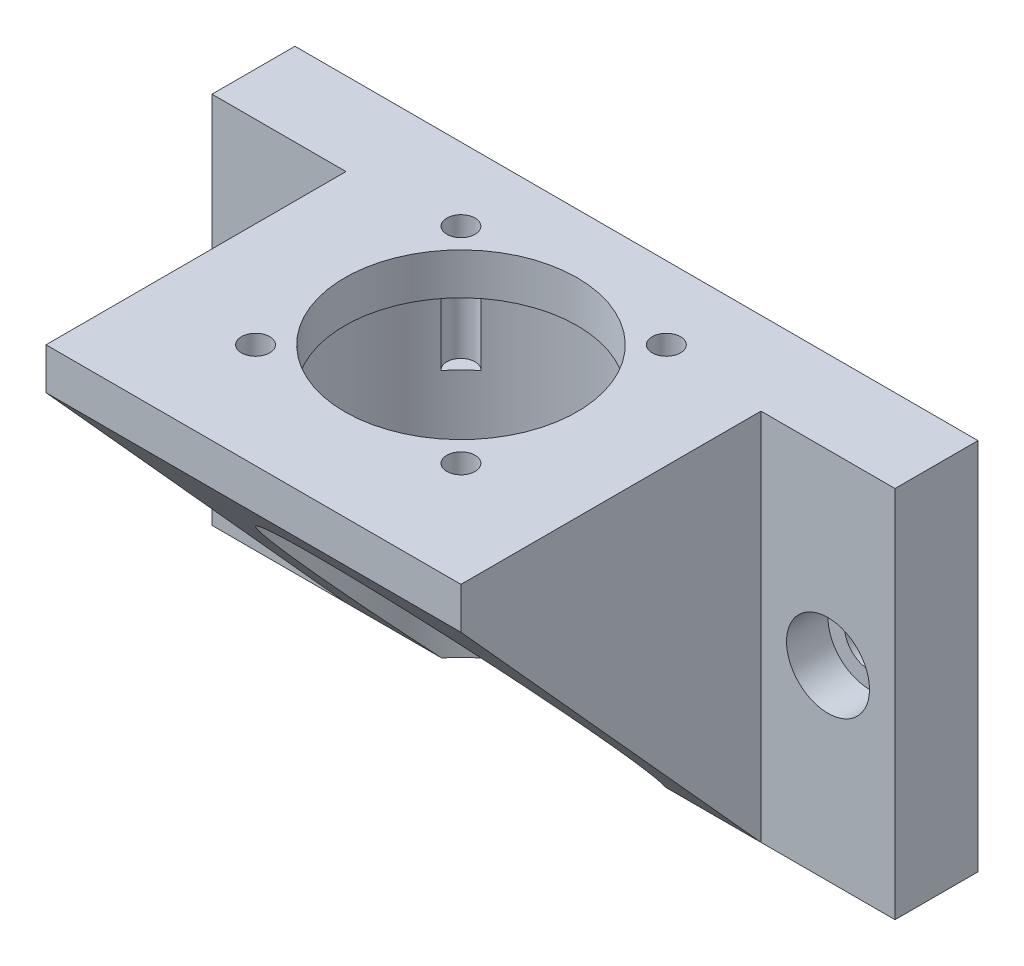
ISO-10303-21;
HEADER;
FILE_DESCRIPTION(('STEP AP214'),'2;1');
FILE_NAME('part.step','',(''),(''),'','','');
FILE_SCHEMA(('AUTOMOTIVE_DESIGN { 1 0 10303 214 1 1 1 1 }'));
ENDSEC;
DATA;
#1=APPLICATION_CONTEXT('core data for automotive mechanical design processes');
#2=APPLICATION_PROTOCOL_DEFINITION('international standard','automotive_design',2000,#1);
#3=PRODUCT_CONTEXT('',#1,'mechanical');
#4=PRODUCT('Part','Part','',(#3));
#5=PRODUCT_RELATED_PRODUCT_CATEGORY('part','',(#4));
#6=PRODUCT_DEFINITION_FORMATION('','',#4);
#7=PRODUCT_DEFINITION_CONTEXT('part definition',#1,'design');
#8=PRODUCT_DEFINITION('design','',#6,#7);
#9=PRODUCT_DEFINITION_SHAPE('','',#8);
#10=(LENGTH_UNIT() NAMED_UNIT(*) SI_UNIT(.MILLI.,.METRE.));
#11=(NAMED_UNIT(*) PLANE_ANGLE_UNIT() SI_UNIT($,.RADIAN.));
#12=(NAMED_UNIT(*) SI_UNIT($,.STERADIAN.) SOLID_ANGLE_UNIT());
#13=UNCERTAINTY_MEASURE_WITH_UNIT(LENGTH_MEASURE(1.E-05),#10,'distance_accuracy_value','');
#14=(GEOMETRIC_REPRESENTATION_CONTEXT(3) GLOBAL_UNCERTAINTY_ASSIGNED_CONTEXT((#13)) GLOBAL_UNIT_ASSIGNED_CONTEXT((#10,
#11,#12)) REPRESENTATION_CONTEXT('',''));
#15=CARTESIAN_POINT('',(0.,0.,0.));
#16=DIRECTION('',(0.,0.,1.));
#17=DIRECTION('',(1.,0.,0.));
#18=AXIS2_PLACEMENT_3D('',#15,#16,#17);
#19=CARTESIAN_POINT('',(33.075,22.5,-21.15));
#20=DIRECTION('',(0.,0.,1.));
#21=DIRECTION('',(1.,0.,0.));
#22=AXIS2_PLACEMENT_3D('',#19,#20,#21);
#23=CYLINDRICAL_SURFACE('',#22,3.);
#24=CARTESIAN_POINT('',(33.075,22.5,-21.15));
#25=DIRECTION('',(0.,0.,1.));
#26=DIRECTION('',(1.,0.,0.));
#27=AXIS2_PLACEMENT_3D('',#24,#25,#26);
#28=CIRCLE('',#27,3.);
#29=CARTESIAN_POINT('',(36.075,22.5,-21.15));
#30=VERTEX_POINT('',#29);
#31=EDGE_CURVE('E234',#30,#30,#28,.T.);
#32=ORIENTED_EDGE('',*,*,#31,.F.);
#33=EDGE_LOOP('',(#32));
#34=FACE_BOUND('',#33,.T.);
#35=CARTESIAN_POINT('',(33.075,22.5,-16.15));
#36=DIRECTION('',(0.,0.,1.));
#37=DIRECTION('',(1.,0.,0.));
#38=AXIS2_PLACEMENT_3D('',#35,#36,#37);
#39=CIRCLE('',#38,3.);
#40=CARTESIAN_POINT('',(36.075,22.5,-16.15));
#41=VERTEX_POINT('',#40);
#42=EDGE_CURVE('E236',#41,#41,#39,.F.);
#43=ORIENTED_EDGE('',*,*,#42,.F.);
#44=EDGE_LOOP('',(#43));
#45=FACE_BOUND('',#44,.T.);
#46=ADVANCED_FACE('F35',(#34,#45),#23,.F.);
#47=CARTESIAN_POINT('',(-33.075,22.5,-21.15));
#48=DIRECTION('',(0.,0.,1.));
#49=DIRECTION('',(1.,0.,0.));
#50=AXIS2_PLACEMENT_3D('',#47,#48,#49);
#51=CYLINDRICAL_SURFACE('',#50,3.);
#52=CARTESIAN_POINT('',(-33.075,22.5,-21.15));
#53=DIRECTION('',(0.,0.,1.));
#54=DIRECTION('',(1.,0.,0.));
#55=AXIS2_PLACEMENT_3D('',#52,#53,#54);
#56=CIRCLE('',#55,3.);
#57=CARTESIAN_POINT('',(-30.075,22.5,-21.15));
#58=VERTEX_POINT('',#57);
#59=EDGE_CURVE('E258',#58,#58,#56,.T.);
#60=ORIENTED_EDGE('',*,*,#59,.F.);
#61=EDGE_LOOP('',(#60));
#62=FACE_BOUND('',#61,.T.);
#63=CARTESIAN_POINT('',(-33.075,22.5,-16.15));
#64=DIRECTION('',(0.,0.,1.));
#65=DIRECTION('',(1.,0.,0.));
#66=AXIS2_PLACEMENT_3D('',#63,#64,#65);
#67=CIRCLE('',#66,3.);
#68=CARTESIAN_POINT('',(-30.075,22.5,-16.15));
#69=VERTEX_POINT('',#68);
#70=EDGE_CURVE('E232',#69,#69,#67,.F.);
#71=ORIENTED_EDGE('',*,*,#70,.F.);
#72=EDGE_LOOP('',(#71));
#73=FACE_BOUND('',#72,.T.);
#74=ADVANCED_FACE('F374',(#62,#73),#51,.F.);
#75=CARTESIAN_POINT('',(-21.15,45.,-21.15));
#76=DIRECTION('',(0.,0.,1.));
#77=DIRECTION('',(1.,0.,0.));
#78=AXIS2_PLACEMENT_3D('',#75,#76,#77);
#79=PLANE('',#78);
#80=ORIENTED_EDGE('',*,*,#31,.T.);
#81=EDGE_LOOP('',(#80));
#82=FACE_BOUND('',#81,.T.);
#83=ORIENTED_EDGE('',*,*,#59,.T.);
#84=EDGE_LOOP('',(#83));
#85=FACE_BOUND('',#84,.T.);
#86=DIRECTION('',(-1.,0.,0.));
#87=VECTOR('',#86,1.);
#88=CARTESIAN_POINT('',(-21.15,0.,-21.15));
#89=LINE('',#88,#87);
#90=CARTESIAN_POINT('',(41.15,0.,-21.15));
#91=VERTEX_POINT('',#90);
#92=CARTESIAN_POINT('',(-41.15,0.,-21.15));
#93=VERTEX_POINT('',#92);
#94=EDGE_CURVE('E316',#91,#93,#89,.T.);
#95=ORIENTED_EDGE('',*,*,#94,.T.);
#96=DIRECTION('',(0.,-1.,0.));
#97=VECTOR('',#96,1.);
#98=CARTESIAN_POINT('',(-41.15,45.,-21.15));
#99=LINE('',#98,#97);
#100=CARTESIAN_POINT('',(-41.15,45.,-21.15));
#101=VERTEX_POINT('',#100);
#102=EDGE_CURVE('E209',#101,#93,#99,.T.);
#103=ORIENTED_EDGE('',*,*,#102,.F.);
#104=DIRECTION('',(-1.,0.,0.));
#105=VECTOR('',#104,1.);
#106=CARTESIAN_POINT('',(21.15,45.,-21.15));
#107=LINE('',#106,#105);
#108=CARTESIAN_POINT('',(41.15,45.,-21.15));
#109=VERTEX_POINT('',#108);
#110=EDGE_CURVE('E187',#109,#101,#107,.T.);
#111=ORIENTED_EDGE('',*,*,#110,.F.);
#112=DIRECTION('',(0.,-1.,0.));
#113=VECTOR('',#112,1.);
#114=CARTESIAN_POINT('',(41.15,45.,-21.15));
#115=LINE('',#114,#113);
#116=EDGE_CURVE('E194',#109,#91,#115,.T.);
#117=ORIENTED_EDGE('',*,*,#116,.T.);
#118=EDGE_LOOP('',(#95,#103,#111,#117));
#119=FACE_BOUND('',#118,.T.);
#120=ADVANCED_FACE('F37',(#82,#85,#119),#79,.F.);
#121=CARTESIAN_POINT('',(-41.15,45.,-21.15));
#122=DIRECTION('',(1.,0.,0.));
#123=DIRECTION('',(0.,0.,-1.));
#124=AXIS2_PLACEMENT_3D('',#121,#122,#123);
#125=PLANE('',#124);
#126=DIRECTION('',(0.,0.,1.));
#127=VECTOR('',#126,1.);
#128=CARTESIAN_POINT('',(-41.15,0.,-21.15));
#129=LINE('',#128,#127);
#130=CARTESIAN_POINT('',(-41.15,0.,-11.15));
#131=VERTEX_POINT('',#130);
#132=EDGE_CURVE('E190',#93,#131,#129,.T.);
#133=ORIENTED_EDGE('',*,*,#132,.T.);
#134=DIRECTION('',(0.,-1.,0.));
#135=VECTOR('',#134,1.);
#136=CARTESIAN_POINT('',(-41.15,45.,-11.15));
#137=LINE('',#136,#135);
#138=CARTESIAN_POINT('',(-41.15,45.,-11.15));
#139=VERTEX_POINT('',#138);
#140=EDGE_CURVE('E206',#139,#131,#137,.T.);
#141=ORIENTED_EDGE('',*,*,#140,.F.);
#142=DIRECTION('',(0.,0.,1.));
#143=VECTOR('',#142,1.);
#144=CARTESIAN_POINT('',(-41.15,45.,-21.15));
#145=LINE('',#144,#143);
#146=EDGE_CURVE('E321',#101,#139,#145,.T.);
#147=ORIENTED_EDGE('',*,*,#146,.F.);
#148=ORIENTED_EDGE('',*,*,#102,.T.);
#149=EDGE_LOOP('',(#133,#141,#147,#148));
#150=FACE_BOUND('',#149,.T.);
#151=ADVANCED_FACE('F336',(#150),#125,.F.);
#152=CARTESIAN_POINT('',(-41.15,45.,-11.15));
#153=DIRECTION('',(0.,0.,-1.));
#154=DIRECTION('',(-1.,0.,0.));
#155=AXIS2_PLACEMENT_3D('',#152,#153,#154);
#156=PLANE('',#155);
#157=CARTESIAN_POINT('',(-33.075,22.5,-11.15));
#158=DIRECTION('',(0.,0.,1.));
#159=DIRECTION('',(1.,0.,0.));
#160=AXIS2_PLACEMENT_3D('',#157,#158,#159);
#161=CIRCLE('',#160,5.);
#162=CARTESIAN_POINT('',(-28.075,22.5,-11.15));
#163=VERTEX_POINT('',#162);
#164=EDGE_CURVE('E238',#163,#163,#161,.T.);
#165=ORIENTED_EDGE('',*,*,#164,.F.);
#166=EDGE_LOOP('',(#165));
#167=FACE_BOUND('',#166,.T.);
#168=DIRECTION('',(1.,0.,0.));
#169=VECTOR('',#168,1.);
#170=CARTESIAN_POINT('',(-41.15,0.,-11.15));
#171=LINE('',#170,#169);
#172=CARTESIAN_POINT('',(-25.,0.,-11.15));
#173=VERTEX_POINT('',#172);
#174=EDGE_CURVE('E185',#131,#173,#171,.T.);
#175=ORIENTED_EDGE('',*,*,#174,.T.);
#176=DIRECTION('',(0.,-1.,0.));
#177=VECTOR('',#176,1.);
#178=CARTESIAN_POINT('',(-25.,45.,-11.15));
#179=LINE('',#178,#177);
#180=CARTESIAN_POINT('',(-25.,45.,-11.15));
#181=VERTEX_POINT('',#180);
#182=EDGE_CURVE('E203',#181,#173,#179,.T.);
#183=ORIENTED_EDGE('',*,*,#182,.F.);
#184=DIRECTION('',(1.,0.,0.));
#185=VECTOR('',#184,1.);
#186=CARTESIAN_POINT('',(-41.15,45.,-11.15));
#187=LINE('',#186,#185);
#188=EDGE_CURVE('E323',#139,#181,#187,.T.);
#189=ORIENTED_EDGE('',*,*,#188,.F.);
#190=ORIENTED_EDGE('',*,*,#140,.T.);
#191=EDGE_LOOP('',(#175,#183,#189,#190));
#192=FACE_BOUND('',#191,.T.);
#193=ADVANCED_FACE('F342',(#167,#192),#156,.F.);
#194=CARTESIAN_POINT('',(-25.,45.,-11.15));
#195=DIRECTION('',(1.,0.,0.));
#196=DIRECTION('',(0.,0.,-1.));
#197=AXIS2_PLACEMENT_3D('',#194,#195,#196);
#198=PLANE('',#197);
#199=ORIENTED_EDGE('',*,*,#182,.T.);
#200=DIRECTION('',(0.,0.741909162750844,0.670500405836075));
#201=VECTOR('',#200,1.);
#202=CARTESIAN_POINT('',(-25.,24.7693142598146,11.2352677623075));
#203=LINE('',#202,#201);
#204=CARTESIAN_POINT('',(-25.,40.,25.));
#205=VERTEX_POINT('',#204);
#206=EDGE_CURVE('E250',#173,#205,#203,.T.);
#207=ORIENTED_EDGE('',*,*,#206,.T.);
#208=DIRECTION('',(0.,-1.,0.));
#209=VECTOR('',#208,1.);
#210=CARTESIAN_POINT('',(-25.,45.,25.));
#211=LINE('',#210,#209);
#212=CARTESIAN_POINT('',(-25.,45.,25.));
#213=VERTEX_POINT('',#212);
#214=EDGE_CURVE('E200',#213,#205,#211,.T.);
#215=ORIENTED_EDGE('',*,*,#214,.F.);
#216=DIRECTION('',(0.,0.,1.));
#217=VECTOR('',#216,1.);
#218=CARTESIAN_POINT('',(-25.,45.,-11.15));
#219=LINE('',#218,#217);
#220=EDGE_CURVE('E325',#181,#213,#219,.T.);
#221=ORIENTED_EDGE('',*,*,#220,.F.);
#222=EDGE_LOOP('',(#199,#207,#215,#221));
#223=FACE_BOUND('',#222,.T.);
#224=ADVANCED_FACE('F350',(#223),#198,.F.);
#225=CARTESIAN_POINT('',(-25.,45.,25.));
#226=DIRECTION('',(0.,0.,-1.));
#227=DIRECTION('',(-1.,0.,0.));
#228=AXIS2_PLACEMENT_3D('',#225,#226,#227);
#229=PLANE('',#228);
#230=ORIENTED_EDGE('',*,*,#214,.T.);
#231=DIRECTION('',(1.,0.,0.));
#232=VECTOR('',#231,1.);
#233=CARTESIAN_POINT('',(-41.15,40.,25.));
#234=LINE('',#233,#232);
#235=CARTESIAN_POINT('',(25.,40.,25.));
#236=VERTEX_POINT('',#235);
#237=EDGE_CURVE('E344',#205,#236,#234,.T.);
#238=ORIENTED_EDGE('',*,*,#237,.T.);
#239=DIRECTION('',(0.,-1.,0.));
#240=VECTOR('',#239,1.);
#241=CARTESIAN_POINT('',(25.,45.,25.));
#242=LINE('',#241,#240);
#243=CARTESIAN_POINT('',(25.,45.,25.));
#244=VERTEX_POINT('',#243);
#245=EDGE_CURVE('E171',#244,#236,#242,.T.);
#246=ORIENTED_EDGE('',*,*,#245,.F.);
#247=DIRECTION('',(1.,0.,0.));
#248=VECTOR('',#247,1.);
#249=CARTESIAN_POINT('',(-25.,45.,25.));
#250=LINE('',#249,#248);
#251=EDGE_CURVE('E327',#213,#244,#250,.T.);
#252=ORIENTED_EDGE('',*,*,#251,.F.);
#253=EDGE_LOOP('',(#230,#238,#246,#252));
#254=FACE_BOUND('',#253,.T.);
#255=ADVANCED_FACE('F353',(#254),#229,.F.);
#256=CARTESIAN_POINT('',(25.,45.,-11.15));
#257=DIRECTION('',(-1.,0.,0.));
#258=DIRECTION('',(0.,0.,1.));
#259=AXIS2_PLACEMENT_3D('',#256,#257,#258);
#260=PLANE('',#259);
#261=ORIENTED_EDGE('',*,*,#245,.T.);
#262=DIRECTION('',(0.,0.741909162750844,0.670500405836075));
#263=VECTOR('',#262,1.);
#264=CARTESIAN_POINT('',(25.,40.,25.));
#265=LINE('',#264,#263);
#266=CARTESIAN_POINT('',(25.,0.,-11.15));
#267=VERTEX_POINT('',#266);
#268=EDGE_CURVE('E155',#267,#236,#265,.T.);
#269=ORIENTED_EDGE('',*,*,#268,.F.);
#270=DIRECTION('',(0.,-1.,0.));
#271=VECTOR('',#270,1.);
#272=CARTESIAN_POINT('',(25.,45.,-11.15));
#273=LINE('',#272,#271);
#274=CARTESIAN_POINT('',(25.,45.,-11.15));
#275=VERTEX_POINT('',#274);
#276=EDGE_CURVE('E168',#275,#267,#273,.T.);
#277=ORIENTED_EDGE('',*,*,#276,.F.);
#278=DIRECTION('',(0.,0.,-1.));
#279=VECTOR('',#278,1.);
#280=CARTESIAN_POINT('',(25.,45.,-11.15));
#281=LINE('',#280,#279);
#282=EDGE_CURVE('E329',#244,#275,#281,.T.);
#283=ORIENTED_EDGE('',*,*,#282,.F.);
#284=EDGE_LOOP('',(#261,#269,#277,#283));
#285=FACE_BOUND('',#284,.T.);
#286=ADVANCED_FACE('F166',(#285),#260,.F.);
#287=CARTESIAN_POINT('',(41.15,45.,-11.15));
#288=DIRECTION('',(0.,0.,-1.));
#289=DIRECTION('',(-1.,0.,0.));
#290=AXIS2_PLACEMENT_3D('',#287,#288,#289);
#291=PLANE('',#290);
#292=CARTESIAN_POINT('',(33.075,22.5,-11.15));
#293=DIRECTION('',(0.,0.,1.));
#294=DIRECTION('',(1.,0.,0.));
#295=AXIS2_PLACEMENT_3D('',#292,#293,#294);
#296=CIRCLE('',#295,5.);
#297=CARTESIAN_POINT('',(38.075,22.5,-11.15));
#298=VERTEX_POINT('',#297);
#299=EDGE_CURVE('E245',#298,#298,#296,.T.);
#300=ORIENTED_EDGE('',*,*,#299,.F.);
#301=EDGE_LOOP('',(#300));
#302=FACE_BOUND('',#301,.T.);
#303=DIRECTION('',(1.,0.,0.));
#304=VECTOR('',#303,1.);
#305=CARTESIAN_POINT('',(41.15,0.,-11.15));
#306=LINE('',#305,#304);
#307=CARTESIAN_POINT('',(41.15,0.,-11.15));
#308=VERTEX_POINT('',#307);
#309=EDGE_CURVE('E176',#267,#308,#306,.T.);
#310=ORIENTED_EDGE('',*,*,#309,.T.);
#311=DIRECTION('',(0.,-1.,0.));
#312=VECTOR('',#311,1.);
#313=CARTESIAN_POINT('',(41.15,45.,-11.15));
#314=LINE('',#313,#312);
#315=CARTESIAN_POINT('',(41.15,45.,-11.15));
#316=VERTEX_POINT('',#315);
#317=EDGE_CURVE('E179',#316,#308,#314,.T.);
#318=ORIENTED_EDGE('',*,*,#317,.F.);
#319=DIRECTION('',(1.,0.,0.));
#320=VECTOR('',#319,1.);
#321=CARTESIAN_POINT('',(41.15,45.,-11.15));
#322=LINE('',#321,#320);
#323=EDGE_CURVE('E178',#275,#316,#322,.T.);
#324=ORIENTED_EDGE('',*,*,#323,.F.);
#325=ORIENTED_EDGE('',*,*,#276,.T.);
#326=EDGE_LOOP('',(#310,#318,#324,#325));
#327=FACE_BOUND('',#326,.T.);
#328=ADVANCED_FACE('F174',(#302,#327),#291,.F.);
#329=CARTESIAN_POINT('',(41.15,45.,-21.15));
#330=DIRECTION('',(-1.,0.,0.));
#331=DIRECTION('',(0.,0.,1.));
#332=AXIS2_PLACEMENT_3D('',#329,#330,#331);
#333=PLANE('',#332);
#334=DIRECTION('',(0.,0.,-1.));
#335=VECTOR('',#334,1.);
#336=CARTESIAN_POINT('',(41.15,0.,-21.15));
#337=LINE('',#336,#335);
#338=EDGE_CURVE('E184',#308,#91,#337,.T.);
#339=ORIENTED_EDGE('',*,*,#338,.T.);
#340=ORIENTED_EDGE('',*,*,#116,.F.);
#341=DIRECTION('',(0.,0.,-1.));
#342=VECTOR('',#341,1.);
#343=CARTESIAN_POINT('',(41.15,45.,-21.15));
#344=LINE('',#343,#342);
#345=EDGE_CURVE('E197',#316,#109,#344,.T.);
#346=ORIENTED_EDGE('',*,*,#345,.F.);
#347=ORIENTED_EDGE('',*,*,#317,.T.);
#348=EDGE_LOOP('',(#339,#340,#346,#347));
#349=FACE_BOUND('',#348,.T.);
#350=ADVANCED_FACE('F361',(#349),#333,.F.);
#351=CARTESIAN_POINT('',(0.,45.,0.));
#352=DIRECTION('',(0.,-1.,0.));
#353=DIRECTION('',(0.,0.,-1.));
#354=AXIS2_PLACEMENT_3D('',#351,#352,#353);
#355=PLANE('',#354);
#356=CARTESIAN_POINT('',(-12.3743686707646,45.,12.3743686707646));
#357=DIRECTION('',(0.,-1.,0.));
#358=DIRECTION('',(0.,0.,-1.));
#359=AXIS2_PLACEMENT_3D('',#356,#357,#358);
#360=CIRCLE('',#359,1.7);
#361=CARTESIAN_POINT('',(-12.3743686707646,45.,10.6743686707646));
#362=VERTEX_POINT('',#361);
#363=EDGE_CURVE('E267',#362,#362,#360,.T.);
#364=ORIENTED_EDGE('',*,*,#363,.T.);
#365=EDGE_LOOP('',(#364));
#366=FACE_BOUND('',#365,.T.);
#367=CARTESIAN_POINT('',(12.3743686707646,45.,12.3743686707646));
#368=DIRECTION('',(0.,-1.,0.));
#369=DIRECTION('',(0.,0.,-1.));
#370=AXIS2_PLACEMENT_3D('',#367,#368,#369);
#371=CIRCLE('',#370,1.7);
#372=CARTESIAN_POINT('',(12.3743686707646,45.,10.6743686707646));
#373=VERTEX_POINT('',#372);
#374=EDGE_CURVE('E279',#373,#373,#371,.T.);
#375=ORIENTED_EDGE('',*,*,#374,.T.);
#376=EDGE_LOOP('',(#375));
#377=FACE_BOUND('',#376,.T.);
#378=CARTESIAN_POINT('',(12.3743686707646,45.,-12.3743686707646));
#379=DIRECTION('',(0.,-1.,0.));
#380=DIRECTION('',(0.,0.,-1.));
#381=AXIS2_PLACEMENT_3D('',#378,#379,#380);
#382=CIRCLE('',#381,1.7);
#383=CARTESIAN_POINT('',(12.3743686707646,45.,-14.0743686707646));
#384=VERTEX_POINT('',#383);
#385=EDGE_CURVE('E291',#384,#384,#382,.T.);
#386=ORIENTED_EDGE('',*,*,#385,.T.);
#387=EDGE_LOOP('',(#386));
#388=FACE_BOUND('',#387,.T.);
#389=CARTESIAN_POINT('',(-12.3743686707646,45.,-12.3743686707646));
#390=DIRECTION('',(0.,-1.,0.));
#391=DIRECTION('',(0.,0.,-1.));
#392=AXIS2_PLACEMENT_3D('',#389,#390,#391);
#393=CIRCLE('',#392,1.7);
#394=CARTESIAN_POINT('',(-12.3743686707646,45.,-14.0743686707646));
#395=VERTEX_POINT('',#394);
#396=EDGE_CURVE('E303',#395,#395,#393,.T.);
#397=ORIENTED_EDGE('',*,*,#396,.T.);
#398=EDGE_LOOP('',(#397));
#399=FACE_BOUND('',#398,.T.);
#400=CARTESIAN_POINT('',(0.,45.,0.));
#401=DIRECTION('',(0.,-1.,0.));
#402=DIRECTION('',(0.,0.,-1.));
#403=AXIS2_PLACEMENT_3D('',#400,#401,#402);
#404=CIRCLE('',#403,14.);
#405=CARTESIAN_POINT('',(0.,45.,-14.));
#406=VERTEX_POINT('',#405);
#407=EDGE_CURVE('E307',#406,#406,#404,.T.);
#408=ORIENTED_EDGE('',*,*,#407,.T.);
#409=EDGE_LOOP('',(#408));
#410=FACE_BOUND('',#409,.T.);
#411=ORIENTED_EDGE('',*,*,#110,.T.);
#412=ORIENTED_EDGE('',*,*,#146,.T.);
#413=ORIENTED_EDGE('',*,*,#188,.T.);
#414=ORIENTED_EDGE('',*,*,#220,.T.);
#415=ORIENTED_EDGE('',*,*,#251,.T.);
#416=ORIENTED_EDGE('',*,*,#282,.T.);
#417=ORIENTED_EDGE('',*,*,#323,.T.);
#418=ORIENTED_EDGE('',*,*,#345,.T.);
#419=EDGE_LOOP('',(#411,#412,#413,#414,#415,#416,#417,#418));
#420=FACE_BOUND('',#419,.T.);
#421=ADVANCED_FACE('F355',(#366,#377,#388,#399,#410,#420),#355,.F.);
#422=CARTESIAN_POINT('',(0.,0.,0.));
#423=DIRECTION('',(0.,-1.,0.));
#424=DIRECTION('',(0.,0.,-1.));
#425=AXIS2_PLACEMENT_3D('',#422,#423,#424);
#426=PLANE('',#425);
#427=DIRECTION('',(1.,0.,0.));
#428=VECTOR('',#427,1.);
#429=CARTESIAN_POINT('',(-41.15,0.,-11.15));
#430=LINE('',#429,#428);
#431=CARTESIAN_POINT('',(-13.4880502668103,0.,-11.15));
#432=VERTEX_POINT('',#431);
#433=EDGE_CURVE('E50',#173,#432,#430,.T.);
#434=ORIENTED_EDGE('',*,*,#433,.F.);
#435=ORIENTED_EDGE('',*,*,#174,.F.);
#436=ORIENTED_EDGE('',*,*,#132,.F.);
#437=ORIENTED_EDGE('',*,*,#94,.F.);
#438=ORIENTED_EDGE('',*,*,#338,.F.);
#439=ORIENTED_EDGE('',*,*,#309,.F.);
#440=CARTESIAN_POINT('',(13.4880502668103,0.,-11.15));
#441=VERTEX_POINT('',#440);
#442=EDGE_CURVE('E152',#441,#267,#430,.T.);
#443=ORIENTED_EDGE('',*,*,#442,.F.);
#444=CARTESIAN_POINT('',(0.,0.,0.));
#445=DIRECTION('',(0.,-1.,0.));
#446=DIRECTION('',(0.,0.,-1.));
#447=AXIS2_PLACEMENT_3D('',#444,#445,#446);
#448=CIRCLE('',#447,17.5);
#449=EDGE_CURVE('E310',#432,#441,#448,.T.);
#450=ORIENTED_EDGE('',*,*,#449,.F.);
#451=EDGE_LOOP('',(#434,#435,#436,#437,#438,#439,#443,#450));
#452=FACE_BOUND('',#451,.T.);
#453=ADVANCED_FACE('F182',(#452),#426,.T.);
#454=CARTESIAN_POINT('',(0.,40.,0.));
#455=DIRECTION('',(0.,-1.,0.));
#456=DIRECTION('',(0.,0.,-1.));
#457=AXIS2_PLACEMENT_3D('',#454,#455,#456);
#458=CYLINDRICAL_SURFACE('',#457,17.5);
#459=CARTESIAN_POINT('',(0.,40.,0.));
#460=DIRECTION('',(0.,-1.,0.));
#461=DIRECTION('',(0.,0.,-1.));
#462=AXIS2_PLACEMENT_3D('',#459,#460,#461);
#463=CIRCLE('',#462,17.5);
#464=CARTESIAN_POINT('',(-13.5166445788508,40.,11.1153191285281));
#465=VERTEX_POINT('',#464);
#466=CARTESIAN_POINT('',(-13.5166445788508,40.,-11.1153191285281));
#467=VERTEX_POINT('',#466);
#468=EDGE_CURVE('E318',#465,#467,#463,.T.);
#469=ORIENTED_EDGE('',*,*,#468,.F.);
#470=DIRECTION('',(0.,-1.,0.));
#471=VECTOR('',#470,1.);
#472=CARTESIAN_POINT('',(-13.5166445788508,35.,11.1153191285281));
#473=LINE('',#472,#471);
#474=CARTESIAN_POINT('',(-13.5166445788508,30.,11.1153191285281));
#475=VERTEX_POINT('',#474);
#476=EDGE_CURVE('E57',#465,#475,#473,.T.);
#477=ORIENTED_EDGE('',*,*,#476,.T.);
#478=CARTESIAN_POINT('',(0.,30.,0.));
#479=DIRECTION('',(0.,-1.,0.));
#480=DIRECTION('',(0.,0.,-1.));
#481=AXIS2_PLACEMENT_3D('',#478,#479,#480);
#482=CIRCLE('',#481,17.5);
#483=CARTESIAN_POINT('',(-11.1153191285281,30.,13.5166445788508));
#484=VERTEX_POINT('',#483);
#485=EDGE_CURVE('E43',#475,#484,#482,.F.);
#486=ORIENTED_EDGE('',*,*,#485,.T.);
#487=DIRECTION('',(0.,-1.,0.));
#488=VECTOR('',#487,1.);
#489=CARTESIAN_POINT('',(-11.1153191285281,35.,13.5166445788508));
#490=LINE('',#489,#488);
#491=CARTESIAN_POINT('',(-11.1153191285281,40.,13.5166445788508));
#492=VERTEX_POINT('',#491);
#493=EDGE_CURVE('E263',#484,#492,#490,.F.);
#494=ORIENTED_EDGE('',*,*,#493,.T.);
#495=CARTESIAN_POINT('',(11.1153191285281,40.,13.5166445788508));
#496=VERTEX_POINT('',#495);
#497=EDGE_CURVE('E640',#496,#492,#463,.T.);
#498=ORIENTED_EDGE('',*,*,#497,.F.);
#499=DIRECTION('',(0.,-1.,0.));
#500=VECTOR('',#499,1.);
#501=CARTESIAN_POINT('',(11.1153191285281,35.,13.5166445788508));
#502=LINE('',#501,#500);
#503=CARTESIAN_POINT('',(11.1153191285281,30.,13.5166445788508));
#504=VERTEX_POINT('',#503);
#505=EDGE_CURVE('E276',#496,#504,#502,.T.);
#506=ORIENTED_EDGE('',*,*,#505,.T.);
#507=CARTESIAN_POINT('',(0.,30.,0.));
#508=DIRECTION('',(0.,-1.,0.));
#509=DIRECTION('',(0.,0.,-1.));
#510=AXIS2_PLACEMENT_3D('',#507,#508,#509);
#511=CIRCLE('',#510,17.5);
#512=CARTESIAN_POINT('',(13.5166445788508,30.,11.1153191285281));
#513=VERTEX_POINT('',#512);
#514=EDGE_CURVE('E225',#504,#513,#511,.F.);
#515=ORIENTED_EDGE('',*,*,#514,.T.);
#516=DIRECTION('',(0.,-1.,0.));
#517=VECTOR('',#516,1.);
#518=CARTESIAN_POINT('',(13.5166445788508,35.,11.1153191285281));
#519=LINE('',#518,#517);
#520=CARTESIAN_POINT('',(13.5166445788508,40.,11.1153191285281));
#521=VERTEX_POINT('',#520);
#522=EDGE_CURVE('E273',#513,#521,#519,.F.);
#523=ORIENTED_EDGE('',*,*,#522,.T.);
#524=CARTESIAN_POINT('',(13.5166445788508,40.,-11.1153191285281));
#525=VERTEX_POINT('',#524);
#526=EDGE_CURVE('E317',#525,#521,#463,.T.);
#527=ORIENTED_EDGE('',*,*,#526,.F.);
#528=DIRECTION('',(0.,-1.,0.));
#529=VECTOR('',#528,1.);
#530=CARTESIAN_POINT('',(13.5166445788508,35.,-11.1153191285281));
#531=LINE('',#530,#529);
#532=CARTESIAN_POINT('',(13.5166445788508,30.,-11.1153191285281));
#533=VERTEX_POINT('',#532);
#534=EDGE_CURVE('E288',#525,#533,#531,.T.);
#535=ORIENTED_EDGE('',*,*,#534,.T.);
#536=CARTESIAN_POINT('',(0.,30.,0.));
#537=DIRECTION('',(0.,-1.,0.));
#538=DIRECTION('',(0.,0.,-1.));
#539=AXIS2_PLACEMENT_3D('',#536,#537,#538);
#540=CIRCLE('',#539,17.5);
#541=CARTESIAN_POINT('',(11.1153191285281,30.,-13.5166445788508));
#542=VERTEX_POINT('',#541);
#543=EDGE_CURVE('E220',#533,#542,#540,.F.);
#544=ORIENTED_EDGE('',*,*,#543,.T.);
#545=DIRECTION('',(0.,-1.,0.));
#546=VECTOR('',#545,1.);
#547=CARTESIAN_POINT('',(11.1153191285281,35.,-13.5166445788508));
#548=LINE('',#547,#546);
#549=CARTESIAN_POINT('',(11.1153191285281,40.,-13.5166445788508));
#550=VERTEX_POINT('',#549);
#551=EDGE_CURVE('E285',#542,#550,#548,.F.);
#552=ORIENTED_EDGE('',*,*,#551,.T.);
#553=CARTESIAN_POINT('',(-11.1153191285281,40.,-13.5166445788508));
#554=VERTEX_POINT('',#553);
#555=EDGE_CURVE('E313',#554,#550,#463,.T.);
#556=ORIENTED_EDGE('',*,*,#555,.F.);
#557=DIRECTION('',(0.,-1.,0.));
#558=VECTOR('',#557,1.);
#559=CARTESIAN_POINT('',(-11.1153191285281,35.,-13.5166445788508));
#560=LINE('',#559,#558);
#561=CARTESIAN_POINT('',(-11.1153191285281,30.,-13.5166445788508));
#562=VERTEX_POINT('',#561);
#563=EDGE_CURVE('E300',#554,#562,#560,.T.);
#564=ORIENTED_EDGE('',*,*,#563,.T.);
#565=CARTESIAN_POINT('',(0.,30.,0.));
#566=DIRECTION('',(0.,-1.,0.));
#567=DIRECTION('',(0.,0.,-1.));
#568=AXIS2_PLACEMENT_3D('',#565,#566,#567);
#569=CIRCLE('',#568,17.5);
#570=CARTESIAN_POINT('',(-13.5166445788508,30.,-11.1153191285281));
#571=VERTEX_POINT('',#570);
#572=EDGE_CURVE('E215',#562,#571,#569,.F.);
#573=ORIENTED_EDGE('',*,*,#572,.T.);
#574=DIRECTION('',(0.,-1.,0.));
#575=VECTOR('',#574,1.);
#576=CARTESIAN_POINT('',(-13.5166445788508,35.,-11.1153191285281));
#577=LINE('',#576,#575);
#578=EDGE_CURVE('E297',#571,#467,#577,.F.);
#579=ORIENTED_EDGE('',*,*,#578,.T.);
#580=EDGE_LOOP('',(#469,#477,#486,#494,#498,#506,#515,#523,#527,#535,#544,#552,#556,#564,#573,#579));
#581=FACE_BOUND('',#580,.T.);
#582=ORIENTED_EDGE('',*,*,#449,.T.);
#583=CARTESIAN_POINT('',(0.,12.3374827109267,0.));
#584=DIRECTION('',(0.,0.670500405836075,-0.741909162750844));
#585=DIRECTION('',(0.,-0.741909162750844,-0.670500405836075));
#586=AXIS2_PLACEMENT_3D('',#583,#584,#585);
#587=ELLIPSE('',#586,26.0999096311933,17.5);
#588=EDGE_CURVE('E11',#441,#432,#587,.F.);
#589=ORIENTED_EDGE('',*,*,#588,.T.);
#590=EDGE_LOOP('',(#582,#589));
#591=FACE_BOUND('',#590,.T.);
#592=ADVANCED_FACE('F427',(#581,#591),#458,.F.);
#593=CARTESIAN_POINT('',(0.,40.,0.));
#594=DIRECTION('',(0.,-1.,0.));
#595=DIRECTION('',(0.,0.,-1.));
#596=AXIS2_PLACEMENT_3D('',#593,#594,#595);
#597=PLANE('',#596);
#598=CARTESIAN_POINT('',(-12.3743686707646,40.,12.3743686707646));
#599=DIRECTION('',(0.,-1.,0.));
#600=DIRECTION('',(0.,0.,-1.));
#601=AXIS2_PLACEMENT_3D('',#598,#599,#600);
#602=CIRCLE('',#601,1.7);
#603=EDGE_CURVE('E228',#465,#492,#602,.T.);
#604=ORIENTED_EDGE('',*,*,#603,.F.);
#605=ORIENTED_EDGE('',*,*,#468,.T.);
#606=CARTESIAN_POINT('',(-12.3743686707646,40.,-12.3743686707646));
#607=DIRECTION('',(0.,-1.,0.));
#608=DIRECTION('',(0.,0.,-1.));
#609=AXIS2_PLACEMENT_3D('',#606,#607,#608);
#610=CIRCLE('',#609,1.7);
#611=EDGE_CURVE('E212',#554,#467,#610,.T.);
#612=ORIENTED_EDGE('',*,*,#611,.F.);
#613=ORIENTED_EDGE('',*,*,#555,.T.);
#614=CARTESIAN_POINT('',(12.3743686707646,40.,-12.3743686707646));
#615=DIRECTION('',(0.,-1.,0.));
#616=DIRECTION('',(0.,0.,-1.));
#617=AXIS2_PLACEMENT_3D('',#614,#615,#616);
#618=CIRCLE('',#617,1.7);
#619=EDGE_CURVE('E218',#525,#550,#618,.T.);
#620=ORIENTED_EDGE('',*,*,#619,.F.);
#621=ORIENTED_EDGE('',*,*,#526,.T.);
#622=CARTESIAN_POINT('',(12.3743686707646,40.,12.3743686707646));
#623=DIRECTION('',(0.,-1.,0.));
#624=DIRECTION('',(0.,0.,-1.));
#625=AXIS2_PLACEMENT_3D('',#622,#623,#624);
#626=CIRCLE('',#625,1.7);
#627=EDGE_CURVE('E223',#496,#521,#626,.T.);
#628=ORIENTED_EDGE('',*,*,#627,.F.);
#629=ORIENTED_EDGE('',*,*,#497,.T.);
#630=EDGE_LOOP('',(#604,#605,#612,#613,#620,#621,#628,#629));
#631=FACE_BOUND('',#630,.T.);
#632=CARTESIAN_POINT('',(0.,40.,0.));
#633=DIRECTION('',(0.,-1.,0.));
#634=DIRECTION('',(0.,0.,-1.));
#635=AXIS2_PLACEMENT_3D('',#632,#633,#634);
#636=CIRCLE('',#635,14.);
#637=CARTESIAN_POINT('',(0.,40.,-14.));
#638=VERTEX_POINT('',#637);
#639=EDGE_CURVE('E306',#638,#638,#636,.T.);
#640=ORIENTED_EDGE('',*,*,#639,.F.);
#641=EDGE_LOOP('',(#640));
#642=FACE_BOUND('',#641,.T.);
#643=ADVANCED_FACE('F423',(#631,#642),#597,.T.);
#644=CARTESIAN_POINT('',(0.,45.,0.));
#645=DIRECTION('',(0.,-1.,0.));
#646=DIRECTION('',(0.,0.,-1.));
#647=AXIS2_PLACEMENT_3D('',#644,#645,#646);
#648=CYLINDRICAL_SURFACE('',#647,14.);
#649=ORIENTED_EDGE('',*,*,#407,.F.);
#650=EDGE_LOOP('',(#649));
#651=FACE_BOUND('',#650,.T.);
#652=ORIENTED_EDGE('',*,*,#639,.T.);
#653=EDGE_LOOP('',(#652));
#654=FACE_BOUND('',#653,.T.);
#655=ADVANCED_FACE('F416',(#651,#654),#648,.F.);
#656=CARTESIAN_POINT('',(-12.3743686707646,30.,-12.3743686707646));
#657=DIRECTION('',(0.,-1.,0.));
#658=DIRECTION('',(0.,0.,-1.));
#659=AXIS2_PLACEMENT_3D('',#656,#657,#658);
#660=PLANE('',#659);
#661=CARTESIAN_POINT('',(-12.3743686707646,30.,-12.3743686707646));
#662=DIRECTION('',(0.,-1.,0.));
#663=DIRECTION('',(0.,0.,-1.));
#664=AXIS2_PLACEMENT_3D('',#661,#662,#663);
#665=CIRCLE('',#664,1.7);
#666=EDGE_CURVE('E294',#571,#562,#665,.T.);
#667=ORIENTED_EDGE('',*,*,#666,.F.);
#668=ORIENTED_EDGE('',*,*,#572,.F.);
#669=EDGE_LOOP('',(#667,#668));
#670=FACE_BOUND('',#669,.T.);
#671=ADVANCED_FACE('F413',(#670),#660,.F.);
#672=CARTESIAN_POINT('',(-12.3743686707646,54.,-12.3743686707646));
#673=DIRECTION('',(0.,-1.,0.));
#674=DIRECTION('',(0.,0.,-1.));
#675=AXIS2_PLACEMENT_3D('',#672,#673,#674);
#676=CYLINDRICAL_SURFACE('',#675,1.7);
#677=ORIENTED_EDGE('',*,*,#611,.T.);
#678=ORIENTED_EDGE('',*,*,#578,.F.);
#679=ORIENTED_EDGE('',*,*,#666,.T.);
#680=ORIENTED_EDGE('',*,*,#563,.F.);
#681=EDGE_LOOP('',(#677,#678,#679,#680));
#682=FACE_BOUND('',#681,.T.);
#683=ORIENTED_EDGE('',*,*,#396,.F.);
#684=EDGE_LOOP('',(#683));
#685=FACE_BOUND('',#684,.T.);
#686=ADVANCED_FACE('F408',(#682,#685),#676,.F.);
#687=CARTESIAN_POINT('',(12.3743686707646,30.,-12.3743686707646));
#688=DIRECTION('',(0.,-1.,0.));
#689=DIRECTION('',(0.,0.,-1.));
#690=AXIS2_PLACEMENT_3D('',#687,#688,#689);
#691=PLANE('',#690);
#692=CARTESIAN_POINT('',(12.3743686707646,30.,-12.3743686707646));
#693=DIRECTION('',(0.,-1.,0.));
#694=DIRECTION('',(0.,0.,-1.));
#695=AXIS2_PLACEMENT_3D('',#692,#693,#694);
#696=CIRCLE('',#695,1.7);
#697=EDGE_CURVE('E282',#542,#533,#696,.T.);
#698=ORIENTED_EDGE('',*,*,#697,.F.);
#699=ORIENTED_EDGE('',*,*,#543,.F.);
#700=EDGE_LOOP('',(#698,#699));
#701=FACE_BOUND('',#700,.T.);
#702=ADVANCED_FACE('F405',(#701),#691,.F.);
#703=CARTESIAN_POINT('',(12.3743686707646,54.,-12.3743686707646));
#704=DIRECTION('',(0.,-1.,0.));
#705=DIRECTION('',(0.,0.,-1.));
#706=AXIS2_PLACEMENT_3D('',#703,#704,#705);
#707=CYLINDRICAL_SURFACE('',#706,1.7);
#708=ORIENTED_EDGE('',*,*,#619,.T.);
#709=ORIENTED_EDGE('',*,*,#551,.F.);
#710=ORIENTED_EDGE('',*,*,#697,.T.);
#711=ORIENTED_EDGE('',*,*,#534,.F.);
#712=EDGE_LOOP('',(#708,#709,#710,#711));
#713=FACE_BOUND('',#712,.T.);
#714=ORIENTED_EDGE('',*,*,#385,.F.);
#715=EDGE_LOOP('',(#714));
#716=FACE_BOUND('',#715,.T.);
#717=ADVANCED_FACE('F400',(#713,#716),#707,.F.);
#718=CARTESIAN_POINT('',(12.3743686707646,30.,12.3743686707646));
#719=DIRECTION('',(0.,-1.,0.));
#720=DIRECTION('',(0.,0.,-1.));
#721=AXIS2_PLACEMENT_3D('',#718,#719,#720);
#722=PLANE('',#721);
#723=CARTESIAN_POINT('',(12.3743686707646,30.,12.3743686707646));
#724=DIRECTION('',(0.,-1.,0.));
#725=DIRECTION('',(0.,0.,-1.));
#726=AXIS2_PLACEMENT_3D('',#723,#724,#725);
#727=CIRCLE('',#726,1.7);
#728=EDGE_CURVE('E270',#513,#504,#727,.T.);
#729=ORIENTED_EDGE('',*,*,#728,.F.);
#730=ORIENTED_EDGE('',*,*,#514,.F.);
#731=EDGE_LOOP('',(#729,#730));
#732=FACE_BOUND('',#731,.T.);
#733=ADVANCED_FACE('F397',(#732),#722,.F.);
#734=CARTESIAN_POINT('',(12.3743686707646,54.,12.3743686707646));
#735=DIRECTION('',(0.,-1.,0.));
#736=DIRECTION('',(0.,0.,-1.));
#737=AXIS2_PLACEMENT_3D('',#734,#735,#736);
#738=CYLINDRICAL_SURFACE('',#737,1.7);
#739=ORIENTED_EDGE('',*,*,#627,.T.);
#740=ORIENTED_EDGE('',*,*,#522,.F.);
#741=ORIENTED_EDGE('',*,*,#728,.T.);
#742=ORIENTED_EDGE('',*,*,#505,.F.);
#743=EDGE_LOOP('',(#739,#740,#741,#742));
#744=FACE_BOUND('',#743,.T.);
#745=ORIENTED_EDGE('',*,*,#374,.F.);
#746=EDGE_LOOP('',(#745));
#747=FACE_BOUND('',#746,.T.);
#748=ADVANCED_FACE('F392',(#744,#747),#738,.F.);
#749=CARTESIAN_POINT('',(-12.3743686707646,30.,12.3743686707646));
#750=DIRECTION('',(0.,-1.,0.));
#751=DIRECTION('',(0.,0.,-1.));
#752=AXIS2_PLACEMENT_3D('',#749,#750,#751);
#753=PLANE('',#752);
#754=CARTESIAN_POINT('',(-12.3743686707646,30.,12.3743686707646));
#755=DIRECTION('',(0.,-1.,0.));
#756=DIRECTION('',(0.,0.,-1.));
#757=AXIS2_PLACEMENT_3D('',#754,#755,#756);
#758=CIRCLE('',#757,1.7);
#759=EDGE_CURVE('E261',#484,#475,#758,.T.);
#760=ORIENTED_EDGE('',*,*,#759,.F.);
#761=ORIENTED_EDGE('',*,*,#485,.F.);
#762=EDGE_LOOP('',(#760,#761));
#763=FACE_BOUND('',#762,.T.);
#764=ADVANCED_FACE('F388',(#763),#753,.F.);
#765=CARTESIAN_POINT('',(-12.3743686707646,54.,12.3743686707646));
#766=DIRECTION('',(0.,-1.,0.));
#767=DIRECTION('',(0.,0.,-1.));
#768=AXIS2_PLACEMENT_3D('',#765,#766,#767);
#769=CYLINDRICAL_SURFACE('',#768,1.7);
#770=ORIENTED_EDGE('',*,*,#603,.T.);
#771=ORIENTED_EDGE('',*,*,#493,.F.);
#772=ORIENTED_EDGE('',*,*,#759,.T.);
#773=ORIENTED_EDGE('',*,*,#476,.F.);
#774=EDGE_LOOP('',(#770,#771,#772,#773));
#775=FACE_BOUND('',#774,.T.);
#776=ORIENTED_EDGE('',*,*,#363,.F.);
#777=EDGE_LOOP('',(#776));
#778=FACE_BOUND('',#777,.T.);
#779=ADVANCED_FACE('F391',(#775,#778),#769,.F.);
#780=CARTESIAN_POINT('',(-33.075,22.5,-16.15));
#781=DIRECTION('',(0.,0.,1.));
#782=DIRECTION('',(1.,0.,0.));
#783=AXIS2_PLACEMENT_3D('',#780,#781,#782);
#784=PLANE('',#783);
#785=CARTESIAN_POINT('',(-33.075,22.5,-16.15));
#786=DIRECTION('',(0.,0.,1.));
#787=DIRECTION('',(1.,0.,0.));
#788=AXIS2_PLACEMENT_3D('',#785,#786,#787);
#789=CIRCLE('',#788,5.);
#790=CARTESIAN_POINT('',(-28.075,22.5,-16.15));
#791=VERTEX_POINT('',#790);
#792=EDGE_CURVE('E235',#791,#791,#789,.T.);
#793=ORIENTED_EDGE('',*,*,#792,.T.);
#794=EDGE_LOOP('',(#793));
#795=FACE_BOUND('',#794,.T.);
#796=ORIENTED_EDGE('',*,*,#70,.T.);
#797=EDGE_LOOP('',(#796));
#798=FACE_BOUND('',#797,.T.);
#799=ADVANCED_FACE('F396',(#795,#798),#784,.T.);
#800=CARTESIAN_POINT('',(-33.075,22.5,-16.15));
#801=DIRECTION('',(0.,0.,1.));
#802=DIRECTION('',(1.,0.,0.));
#803=AXIS2_PLACEMENT_3D('',#800,#801,#802);
#804=CYLINDRICAL_SURFACE('',#803,5.);
#805=ORIENTED_EDGE('',*,*,#792,.F.);
#806=EDGE_LOOP('',(#805));
#807=FACE_BOUND('',#806,.T.);
#808=ORIENTED_EDGE('',*,*,#164,.T.);
#809=EDGE_LOOP('',(#808));
#810=FACE_BOUND('',#809,.T.);
#811=ADVANCED_FACE('F385',(#807,#810),#804,.F.);
#812=CARTESIAN_POINT('',(33.075,22.5,-16.15));
#813=DIRECTION('',(0.,0.,1.));
#814=DIRECTION('',(1.,0.,0.));
#815=AXIS2_PLACEMENT_3D('',#812,#813,#814);
#816=PLANE('',#815);
#817=CARTESIAN_POINT('',(33.075,22.5,-16.15));
#818=DIRECTION('',(0.,0.,1.));
#819=DIRECTION('',(1.,0.,0.));
#820=AXIS2_PLACEMENT_3D('',#817,#818,#819);
#821=CIRCLE('',#820,5.);
#822=CARTESIAN_POINT('',(38.075,22.5,-16.15));
#823=VERTEX_POINT('',#822);
#824=EDGE_CURVE('E239',#823,#823,#821,.T.);
#825=ORIENTED_EDGE('',*,*,#824,.T.);
#826=EDGE_LOOP('',(#825));
#827=FACE_BOUND('',#826,.T.);
#828=ORIENTED_EDGE('',*,*,#42,.T.);
#829=EDGE_LOOP('',(#828));
#830=FACE_BOUND('',#829,.T.);
#831=ADVANCED_FACE('F496',(#827,#830),#816,.T.);
#832=CARTESIAN_POINT('',(33.075,22.5,-16.15));
#833=DIRECTION('',(0.,0.,1.));
#834=DIRECTION('',(1.,0.,0.));
#835=AXIS2_PLACEMENT_3D('',#832,#833,#834);
#836=CYLINDRICAL_SURFACE('',#835,5.);
#837=ORIENTED_EDGE('',*,*,#824,.F.);
#838=EDGE_LOOP('',(#837));
#839=FACE_BOUND('',#838,.T.);
#840=ORIENTED_EDGE('',*,*,#299,.T.);
#841=EDGE_LOOP('',(#840));
#842=FACE_BOUND('',#841,.T.);
#843=ADVANCED_FACE('F503',(#839,#842),#836,.F.);
#844=CARTESIAN_POINT('',(-41.15,40.,25.));
#845=DIRECTION('',(0.,0.670500405836075,-0.741909162750844));
#846=DIRECTION('',(0.,0.741909162750844,0.670500405836075));
#847=AXIS2_PLACEMENT_3D('',#844,#845,#846);
#848=PLANE('',#847);
#849=ORIENTED_EDGE('',*,*,#433,.T.);
#850=ORIENTED_EDGE('',*,*,#588,.F.);
#851=ORIENTED_EDGE('',*,*,#442,.T.);
#852=ORIENTED_EDGE('',*,*,#268,.T.);
#853=ORIENTED_EDGE('',*,*,#237,.F.);
#854=ORIENTED_EDGE('',*,*,#206,.F.);
#855=EDGE_LOOP('',(#849,#850,#851,#852,#853,#854));
#856=FACE_BOUND('',#855,.T.);
#857=ADVANCED_FACE('F154',(#856),#848,.F.);
#858=CLOSED_SHELL('',(#46,#74,#120,#151,#193,#224,#255,#286,#328,#350,#421,#453,#592,#643,#655,
#671,#686,#702,#717,#733,#748,#764,#779,#799,#811,#831,#843,#857));
#859=MANIFOLD_SOLID_BREP('B2',#858);
#860=ADVANCED_BREP_SHAPE_REPRESENTATION('',(#18,#859),#14);
#861=SHAPE_DEFINITION_REPRESENTATION(#9,#860);
ENDSEC;
END-ISO-10303-21;
